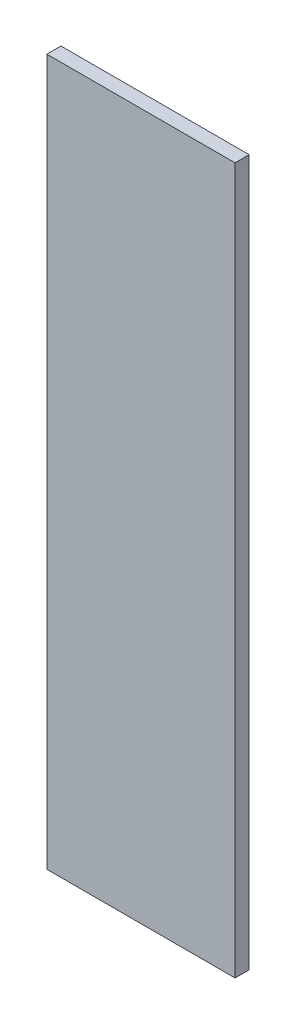
ISO-10303-21;
HEADER;
FILE_DESCRIPTION(('STEP AP214'),'2;1');
FILE_NAME('part.step','',(''),(''),'','','');
FILE_SCHEMA(('AUTOMOTIVE_DESIGN { 1 0 10303 214 1 1 1 1 }'));
ENDSEC;
DATA;
#1=APPLICATION_CONTEXT('core data for automotive mechanical design processes');
#2=APPLICATION_PROTOCOL_DEFINITION('international standard','automotive_design',2000,#1);
#3=PRODUCT_CONTEXT('',#1,'mechanical');
#4=PRODUCT('Part','Part','',(#3));
#5=PRODUCT_RELATED_PRODUCT_CATEGORY('part','',(#4));
#6=PRODUCT_DEFINITION_FORMATION('','',#4);
#7=PRODUCT_DEFINITION_CONTEXT('part definition',#1,'design');
#8=PRODUCT_DEFINITION('design','',#6,#7);
#9=PRODUCT_DEFINITION_SHAPE('','',#8);
#10=(LENGTH_UNIT() NAMED_UNIT(*) SI_UNIT(.MILLI.,.METRE.));
#11=(NAMED_UNIT(*) PLANE_ANGLE_UNIT() SI_UNIT($,.RADIAN.));
#12=(NAMED_UNIT(*) SI_UNIT($,.STERADIAN.) SOLID_ANGLE_UNIT());
#13=UNCERTAINTY_MEASURE_WITH_UNIT(LENGTH_MEASURE(1.E-05),#10,'distance_accuracy_value','');
#14=(GEOMETRIC_REPRESENTATION_CONTEXT(3) GLOBAL_UNCERTAINTY_ASSIGNED_CONTEXT((#13)) GLOBAL_UNIT_ASSIGNED_CONTEXT((#10,
#11,#12)) REPRESENTATION_CONTEXT('',''));
#15=CARTESIAN_POINT('',(0.,0.,0.));
#16=DIRECTION('',(0.,0.,1.));
#17=DIRECTION('',(1.,0.,0.));
#18=AXIS2_PLACEMENT_3D('',#15,#16,#17);
#19=CARTESIAN_POINT('',(0.,0.,-3.));
#20=DIRECTION('',(-1.,0.,0.));
#21=DIRECTION('',(0.,0.,1.));
#22=AXIS2_PLACEMENT_3D('',#19,#20,#21);
#23=PLANE('',#22);
#24=DIRECTION('',(0.,-1.,0.));
#25=VECTOR('',#24,1.);
#26=CARTESIAN_POINT('',(0.,0.,0.));
#27=LINE('',#26,#25);
#28=CARTESIAN_POINT('',(0.,150.,0.));
#29=VERTEX_POINT('',#28);
#30=CARTESIAN_POINT('',(0.,0.,0.));
#31=VERTEX_POINT('',#30);
#32=EDGE_CURVE('E101',#29,#31,#27,.T.);
#33=ORIENTED_EDGE('',*,*,#32,.F.);
#34=DIRECTION('',(0.,0.,1.));
#35=VECTOR('',#34,1.);
#36=CARTESIAN_POINT('',(0.,150.,-3.));
#37=LINE('',#36,#35);
#38=CARTESIAN_POINT('',(0.,150.,-3.));
#39=VERTEX_POINT('',#38);
#40=EDGE_CURVE('E11',#39,#29,#37,.T.);
#41=ORIENTED_EDGE('',*,*,#40,.F.);
#42=DIRECTION('',(0.,-1.,0.));
#43=VECTOR('',#42,1.);
#44=CARTESIAN_POINT('',(0.,0.,-3.));
#45=LINE('',#44,#43);
#46=CARTESIAN_POINT('',(0.,0.,-3.));
#47=VERTEX_POINT('',#46);
#48=EDGE_CURVE('E95',#39,#47,#45,.T.);
#49=ORIENTED_EDGE('',*,*,#48,.T.);
#50=DIRECTION('',(0.,0.,1.));
#51=VECTOR('',#50,1.);
#52=CARTESIAN_POINT('',(0.,0.,-3.));
#53=LINE('',#52,#51);
#54=EDGE_CURVE('E40',#47,#31,#53,.T.);
#55=ORIENTED_EDGE('',*,*,#54,.T.);
#56=EDGE_LOOP('',(#33,#41,#49,#55));
#57=FACE_BOUND('',#56,.T.);
#58=ADVANCED_FACE('F37',(#57),#23,.T.);
#59=CARTESIAN_POINT('',(0.,150.,-3.));
#60=DIRECTION('',(0.,1.,0.));
#61=DIRECTION('',(0.,0.,1.));
#62=AXIS2_PLACEMENT_3D('',#59,#60,#61);
#63=PLANE('',#62);
#64=DIRECTION('',(-1.,0.,0.));
#65=VECTOR('',#64,1.);
#66=CARTESIAN_POINT('',(0.,150.,0.));
#67=LINE('',#66,#65);
#68=CARTESIAN_POINT('',(40.,150.,0.));
#69=VERTEX_POINT('',#68);
#70=EDGE_CURVE('E97',#69,#29,#67,.T.);
#71=ORIENTED_EDGE('',*,*,#70,.F.);
#72=DIRECTION('',(0.,0.,1.));
#73=VECTOR('',#72,1.);
#74=CARTESIAN_POINT('',(40.,150.,-3.));
#75=LINE('',#74,#73);
#76=CARTESIAN_POINT('',(40.,150.,-3.));
#77=VERTEX_POINT('',#76);
#78=EDGE_CURVE('E46',#77,#69,#75,.T.);
#79=ORIENTED_EDGE('',*,*,#78,.F.);
#80=DIRECTION('',(-1.,0.,0.));
#81=VECTOR('',#80,1.);
#82=CARTESIAN_POINT('',(0.,150.,-3.));
#83=LINE('',#82,#81);
#84=EDGE_CURVE('E92',#77,#39,#83,.T.);
#85=ORIENTED_EDGE('',*,*,#84,.T.);
#86=ORIENTED_EDGE('',*,*,#40,.T.);
#87=EDGE_LOOP('',(#71,#79,#85,#86));
#88=FACE_BOUND('',#87,.T.);
#89=ADVANCED_FACE('F111',(#88),#63,.T.);
#90=CARTESIAN_POINT('',(40.,0.,-3.));
#91=DIRECTION('',(1.,0.,0.));
#92=DIRECTION('',(0.,0.,-1.));
#93=AXIS2_PLACEMENT_3D('',#90,#91,#92);
#94=PLANE('',#93);
#95=DIRECTION('',(0.,1.,0.));
#96=VECTOR('',#95,1.);
#97=CARTESIAN_POINT('',(40.,0.,0.));
#98=LINE('',#97,#96);
#99=CARTESIAN_POINT('',(40.,0.,0.));
#100=VERTEX_POINT('',#99);
#101=EDGE_CURVE('E87',#100,#69,#98,.T.);
#102=ORIENTED_EDGE('',*,*,#101,.F.);
#103=DIRECTION('',(0.,0.,1.));
#104=VECTOR('',#103,1.);
#105=CARTESIAN_POINT('',(40.,0.,-3.));
#106=LINE('',#105,#104);
#107=CARTESIAN_POINT('',(40.,0.,-3.));
#108=VERTEX_POINT('',#107);
#109=EDGE_CURVE('E82',#108,#100,#106,.T.);
#110=ORIENTED_EDGE('',*,*,#109,.F.);
#111=DIRECTION('',(0.,1.,0.));
#112=VECTOR('',#111,1.);
#113=CARTESIAN_POINT('',(40.,0.,-3.));
#114=LINE('',#113,#112);
#115=EDGE_CURVE('E85',#108,#77,#114,.T.);
#116=ORIENTED_EDGE('',*,*,#115,.T.);
#117=ORIENTED_EDGE('',*,*,#78,.T.);
#118=EDGE_LOOP('',(#102,#110,#116,#117));
#119=FACE_BOUND('',#118,.T.);
#120=ADVANCED_FACE('F84',(#119),#94,.T.);
#121=CARTESIAN_POINT('',(0.,0.,-3.));
#122=DIRECTION('',(0.,-1.,0.));
#123=DIRECTION('',(0.,0.,-1.));
#124=AXIS2_PLACEMENT_3D('',#121,#122,#123);
#125=PLANE('',#124);
#126=DIRECTION('',(1.,0.,0.));
#127=VECTOR('',#126,1.);
#128=CARTESIAN_POINT('',(0.,0.,0.));
#129=LINE('',#128,#127);
#130=EDGE_CURVE('E104',#31,#100,#129,.T.);
#131=ORIENTED_EDGE('',*,*,#130,.F.);
#132=ORIENTED_EDGE('',*,*,#54,.F.);
#133=DIRECTION('',(1.,0.,0.));
#134=VECTOR('',#133,1.);
#135=CARTESIAN_POINT('',(0.,0.,-3.));
#136=LINE('',#135,#134);
#137=EDGE_CURVE('E91',#47,#108,#136,.T.);
#138=ORIENTED_EDGE('',*,*,#137,.T.);
#139=ORIENTED_EDGE('',*,*,#109,.T.);
#140=EDGE_LOOP('',(#131,#132,#138,#139));
#141=FACE_BOUND('',#140,.T.);
#142=ADVANCED_FACE('F94',(#141),#125,.T.);
#143=CARTESIAN_POINT('',(0.,0.,-3.));
#144=DIRECTION('',(0.,0.,-1.));
#145=DIRECTION('',(-1.,0.,0.));
#146=AXIS2_PLACEMENT_3D('',#143,#144,#145);
#147=PLANE('',#146);
#148=ORIENTED_EDGE('',*,*,#48,.F.);
#149=ORIENTED_EDGE('',*,*,#84,.F.);
#150=ORIENTED_EDGE('',*,*,#115,.F.);
#151=ORIENTED_EDGE('',*,*,#137,.F.);
#152=EDGE_LOOP('',(#148,#149,#150,#151));
#153=FACE_BOUND('',#152,.T.);
#154=ADVANCED_FACE('F90',(#153),#147,.T.);
#155=CARTESIAN_POINT('',(0.,0.,0.));
#156=DIRECTION('',(0.,0.,-1.));
#157=DIRECTION('',(-1.,0.,0.));
#158=AXIS2_PLACEMENT_3D('',#155,#156,#157);
#159=PLANE('',#158);
#160=ORIENTED_EDGE('',*,*,#32,.T.);
#161=ORIENTED_EDGE('',*,*,#130,.T.);
#162=ORIENTED_EDGE('',*,*,#101,.T.);
#163=ORIENTED_EDGE('',*,*,#70,.T.);
#164=EDGE_LOOP('',(#160,#161,#162,#163));
#165=FACE_BOUND('',#164,.T.);
#166=ADVANCED_FACE('F110',(#165),#159,.F.);
#167=CLOSED_SHELL('',(#58,#89,#120,#142,#154,#166));
#168=MANIFOLD_SOLID_BREP('B2',#167);
#169=ADVANCED_BREP_SHAPE_REPRESENTATION('',(#18,#168),#14);
#170=SHAPE_DEFINITION_REPRESENTATION(#9,#169);
ENDSEC;
END-ISO-10303-21;
